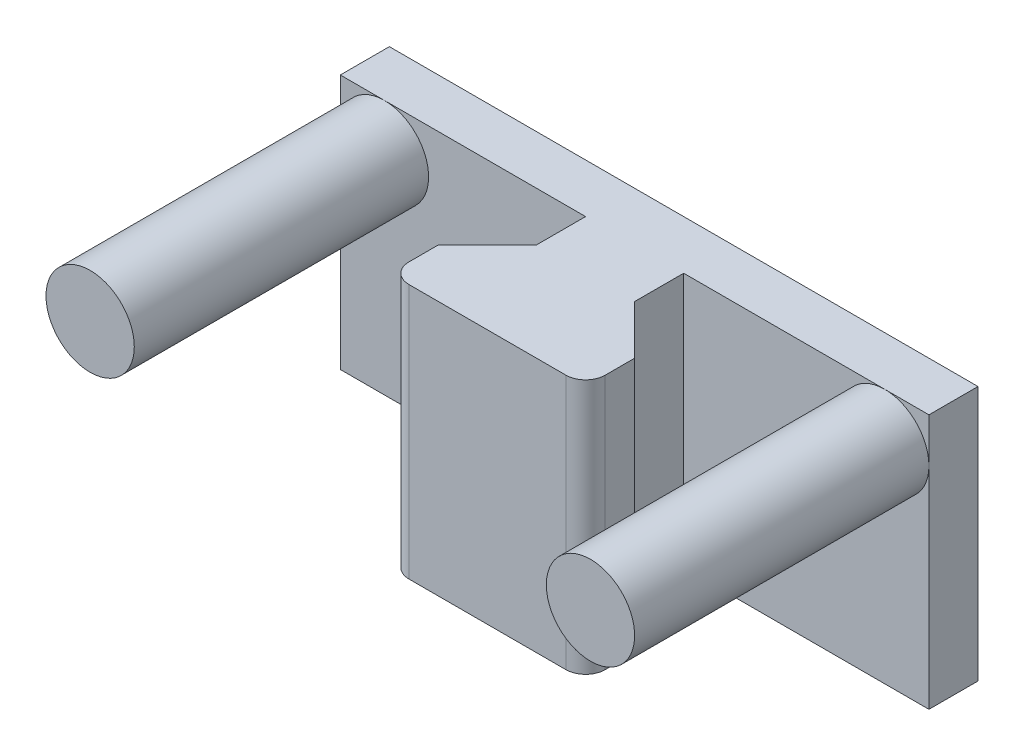
ISO-10303-21;
HEADER;
FILE_DESCRIPTION(('STEP AP214'),'2;1');
FILE_NAME('part.step','',(''),(''),'','','');
FILE_SCHEMA(('AUTOMOTIVE_DESIGN { 1 0 10303 214 1 1 1 1 }'));
ENDSEC;
DATA;
#1=APPLICATION_CONTEXT('core data for automotive mechanical design processes');
#2=APPLICATION_PROTOCOL_DEFINITION('international standard','automotive_design',2000,#1);
#3=PRODUCT_CONTEXT('',#1,'mechanical');
#4=PRODUCT('Part','Part','',(#3));
#5=PRODUCT_RELATED_PRODUCT_CATEGORY('part','',(#4));
#6=PRODUCT_DEFINITION_FORMATION('','',#4);
#7=PRODUCT_DEFINITION_CONTEXT('part definition',#1,'design');
#8=PRODUCT_DEFINITION('design','',#6,#7);
#9=PRODUCT_DEFINITION_SHAPE('','',#8);
#10=(LENGTH_UNIT() NAMED_UNIT(*) SI_UNIT(.MILLI.,.METRE.));
#11=(NAMED_UNIT(*) PLANE_ANGLE_UNIT() SI_UNIT($,.RADIAN.));
#12=(NAMED_UNIT(*) SI_UNIT($,.STERADIAN.) SOLID_ANGLE_UNIT());
#13=UNCERTAINTY_MEASURE_WITH_UNIT(LENGTH_MEASURE(1.E-05),#10,'distance_accuracy_value','');
#14=(GEOMETRIC_REPRESENTATION_CONTEXT(3) GLOBAL_UNCERTAINTY_ASSIGNED_CONTEXT((#13)) GLOBAL_UNIT_ASSIGNED_CONTEXT((#10,
#11,#12)) REPRESENTATION_CONTEXT('',''));
#15=CARTESIAN_POINT('',(0.,0.,0.));
#16=DIRECTION('',(0.,0.,1.));
#17=DIRECTION('',(1.,0.,0.));
#18=AXIS2_PLACEMENT_3D('',#15,#16,#17);
#19=CARTESIAN_POINT('',(0.,26.,-15.));
#20=DIRECTION('',(0.,0.,-1.));
#21=DIRECTION('',(-1.,0.,0.));
#22=AXIS2_PLACEMENT_3D('',#19,#20,#21);
#23=PLANE('',#22);
#24=DIRECTION('',(1.,0.,0.));
#25=VECTOR('',#24,1.);
#26=CARTESIAN_POINT('',(0.,26.,-15.));
#27=LINE('',#26,#25);
#28=CARTESIAN_POINT('',(25.5,26.,-15.));
#29=VERTEX_POINT('',#28);
#30=CARTESIAN_POINT('',(30.,26.,-15.));
#31=VERTEX_POINT('',#30);
#32=EDGE_CURVE('E160',#29,#31,#27,.T.);
#33=ORIENTED_EDGE('',*,*,#32,.F.);
#34=CARTESIAN_POINT('',(25.5,21.5,-15.));
#35=DIRECTION('',(0.,0.,-1.));
#36=DIRECTION('',(-1.,0.,0.));
#37=AXIS2_PLACEMENT_3D('',#34,#35,#36);
#38=CIRCLE('',#37,4.5);
#39=CARTESIAN_POINT('',(30.,21.5,-15.));
#40=VERTEX_POINT('',#39);
#41=EDGE_CURVE('E149',#29,#40,#38,.T.);
#42=ORIENTED_EDGE('',*,*,#41,.T.);
#43=DIRECTION('',(0.,-1.,0.));
#44=VECTOR('',#43,1.);
#45=CARTESIAN_POINT('',(30.,26.,-15.));
#46=LINE('',#45,#44);
#47=EDGE_CURVE('E158',#31,#40,#46,.T.);
#48=ORIENTED_EDGE('',*,*,#47,.F.);
#49=EDGE_LOOP('',(#33,#42,#48));
#50=FACE_BOUND('',#49,.T.);
#51=ADVANCED_FACE('F36',(#50),#23,.F.);
#52=CARTESIAN_POINT('',(0.,26.,-15.));
#53=DIRECTION('',(0.,0.,1.));
#54=DIRECTION('',(1.,0.,0.));
#55=AXIS2_PLACEMENT_3D('',#52,#53,#54);
#56=PLANE('',#55);
#57=DIRECTION('',(0.,-1.,0.));
#58=VECTOR('',#57,1.);
#59=CARTESIAN_POINT('',(-30.,26.,-15.));
#60=LINE('',#59,#58);
#61=CARTESIAN_POINT('',(-30.,26.,-15.));
#62=VERTEX_POINT('',#61);
#63=CARTESIAN_POINT('',(-30.,21.5,-15.));
#64=VERTEX_POINT('',#63);
#65=EDGE_CURVE('E268',#62,#64,#60,.T.);
#66=ORIENTED_EDGE('',*,*,#65,.T.);
#67=CARTESIAN_POINT('',(-25.5,21.5,-15.));
#68=DIRECTION('',(0.,0.,1.));
#69=DIRECTION('',(1.,0.,0.));
#70=AXIS2_PLACEMENT_3D('',#67,#68,#69);
#71=CIRCLE('',#70,4.5);
#72=CARTESIAN_POINT('',(-25.5,26.,-15.));
#73=VERTEX_POINT('',#72);
#74=EDGE_CURVE('E290',#73,#64,#71,.T.);
#75=ORIENTED_EDGE('',*,*,#74,.F.);
#76=DIRECTION('',(-1.,0.,0.));
#77=VECTOR('',#76,1.);
#78=CARTESIAN_POINT('',(0.,26.,-15.));
#79=LINE('',#78,#77);
#80=EDGE_CURVE('E292',#73,#62,#79,.T.);
#81=ORIENTED_EDGE('',*,*,#80,.T.);
#82=EDGE_LOOP('',(#66,#75,#81));
#83=FACE_BOUND('',#82,.T.);
#84=ADVANCED_FACE('F289',(#83),#56,.T.);
#85=CARTESIAN_POINT('',(0.,26.,0.));
#86=DIRECTION('',(0.,0.,1.));
#87=DIRECTION('',(1.,0.,0.));
#88=AXIS2_PLACEMENT_3D('',#85,#86,#87);
#89=PLANE('',#88);
#90=DIRECTION('',(-1.,0.,0.));
#91=VECTOR('',#90,1.);
#92=CARTESIAN_POINT('',(0.,0.,0.));
#93=LINE('',#92,#91);
#94=CARTESIAN_POINT('',(8.,0.,0.));
#95=VERTEX_POINT('',#94);
#96=CARTESIAN_POINT('',(-8.,0.,0.));
#97=VERTEX_POINT('',#96);
#98=EDGE_CURVE('E235',#95,#97,#93,.T.);
#99=ORIENTED_EDGE('',*,*,#98,.F.);
#100=DIRECTION('',(0.,-1.,0.));
#101=VECTOR('',#100,1.);
#102=CARTESIAN_POINT('',(8.,26.,0.));
#103=LINE('',#102,#101);
#104=CARTESIAN_POINT('',(8.,26.,0.));
#105=VERTEX_POINT('',#104);
#106=EDGE_CURVE('E195',#95,#105,#103,.F.);
#107=ORIENTED_EDGE('',*,*,#106,.T.);
#108=DIRECTION('',(-1.,0.,0.));
#109=VECTOR('',#108,1.);
#110=CARTESIAN_POINT('',(0.,26.,0.));
#111=LINE('',#110,#109);
#112=CARTESIAN_POINT('',(-8.,26.,0.));
#113=VERTEX_POINT('',#112);
#114=EDGE_CURVE('E259',#105,#113,#111,.T.);
#115=ORIENTED_EDGE('',*,*,#114,.T.);
#116=DIRECTION('',(0.,-1.,0.));
#117=VECTOR('',#116,1.);
#118=CARTESIAN_POINT('',(-8.,26.,0.));
#119=LINE('',#118,#117);
#120=EDGE_CURVE('E192',#113,#97,#119,.T.);
#121=ORIENTED_EDGE('',*,*,#120,.T.);
#122=EDGE_LOOP('',(#99,#107,#115,#121));
#123=FACE_BOUND('',#122,.T.);
#124=ADVANCED_FACE('F319',(#123),#89,.T.);
#125=CARTESIAN_POINT('',(10.,26.,0.));
#126=DIRECTION('',(-1.,0.,0.));
#127=DIRECTION('',(0.,0.,1.));
#128=AXIS2_PLACEMENT_3D('',#125,#126,#127);
#129=PLANE('',#128);
#130=DIRECTION('',(0.,0.,-1.));
#131=VECTOR('',#130,1.);
#132=CARTESIAN_POINT('',(10.,26.,0.));
#133=LINE('',#132,#131);
#134=CARTESIAN_POINT('',(10.,26.,-2.));
#135=VERTEX_POINT('',#134);
#136=CARTESIAN_POINT('',(10.,26.,-5.));
#137=VERTEX_POINT('',#136);
#138=EDGE_CURVE('E218',#135,#137,#133,.T.);
#139=ORIENTED_EDGE('',*,*,#138,.F.);
#140=DIRECTION('',(0.,-1.,0.));
#141=VECTOR('',#140,1.);
#142=CARTESIAN_POINT('',(10.,0.,-2.));
#143=LINE('',#142,#141);
#144=CARTESIAN_POINT('',(10.,0.,-2.));
#145=VERTEX_POINT('',#144);
#146=EDGE_CURVE('E185',#135,#145,#143,.T.);
#147=ORIENTED_EDGE('',*,*,#146,.T.);
#148=DIRECTION('',(0.,0.,-1.));
#149=VECTOR('',#148,1.);
#150=CARTESIAN_POINT('',(10.,0.,0.));
#151=LINE('',#150,#149);
#152=CARTESIAN_POINT('',(10.,0.,-5.));
#153=VERTEX_POINT('',#152);
#154=EDGE_CURVE('E230',#145,#153,#151,.T.);
#155=ORIENTED_EDGE('',*,*,#154,.T.);
#156=DIRECTION('',(0.,-1.,0.));
#157=VECTOR('',#156,1.);
#158=CARTESIAN_POINT('',(10.,26.,-5.));
#159=LINE('',#158,#157);
#160=EDGE_CURVE('E178',#137,#153,#159,.T.);
#161=ORIENTED_EDGE('',*,*,#160,.F.);
#162=EDGE_LOOP('',(#139,#147,#155,#161));
#163=FACE_BOUND('',#162,.T.);
#164=ADVANCED_FACE('F233',(#163),#129,.F.);
#165=CARTESIAN_POINT('',(5.,26.,0.));
#166=DIRECTION('',(-1.,0.,0.));
#167=DIRECTION('',(0.,0.,1.));
#168=AXIS2_PLACEMENT_3D('',#165,#166,#167);
#169=PLANE('',#168);
#170=DIRECTION('',(0.,0.,-1.));
#171=VECTOR('',#170,1.);
#172=CARTESIAN_POINT('',(5.,26.,0.));
#173=LINE('',#172,#171);
#174=CARTESIAN_POINT('',(5.,26.,-10.));
#175=VERTEX_POINT('',#174);
#176=CARTESIAN_POINT('',(5.,26.,-15.));
#177=VERTEX_POINT('',#176);
#178=EDGE_CURVE('E215',#175,#177,#173,.T.);
#179=ORIENTED_EDGE('',*,*,#178,.F.);
#180=DIRECTION('',(0.,-1.,0.));
#181=VECTOR('',#180,1.);
#182=CARTESIAN_POINT('',(5.,0.,-10.));
#183=LINE('',#182,#181);
#184=CARTESIAN_POINT('',(5.,0.,-10.));
#185=VERTEX_POINT('',#184);
#186=EDGE_CURVE('E203',#175,#185,#183,.T.);
#187=ORIENTED_EDGE('',*,*,#186,.T.);
#188=DIRECTION('',(0.,0.,-1.));
#189=VECTOR('',#188,1.);
#190=CARTESIAN_POINT('',(5.,0.,0.));
#191=LINE('',#190,#189);
#192=CARTESIAN_POINT('',(5.,0.,-15.));
#193=VERTEX_POINT('',#192);
#194=EDGE_CURVE('E231',#185,#193,#191,.T.);
#195=ORIENTED_EDGE('',*,*,#194,.T.);
#196=DIRECTION('',(0.,-1.,0.));
#197=VECTOR('',#196,1.);
#198=CARTESIAN_POINT('',(5.,26.,-15.));
#199=LINE('',#198,#197);
#200=EDGE_CURVE('E177',#177,#193,#199,.T.);
#201=ORIENTED_EDGE('',*,*,#200,.F.);
#202=EDGE_LOOP('',(#179,#187,#195,#201));
#203=FACE_BOUND('',#202,.T.);
#204=ADVANCED_FACE('F223',(#203),#169,.F.);
#205=CARTESIAN_POINT('',(30.,0.,-15.));
#206=VERTEX_POINT('',#205);
#207=EDGE_CURVE('E164',#40,#206,#46,.T.);
#208=ORIENTED_EDGE('',*,*,#207,.F.);
#209=EDGE_CURVE('E146',#40,#29,#38,.T.);
#210=ORIENTED_EDGE('',*,*,#209,.T.);
#211=EDGE_CURVE('E326',#177,#29,#27,.T.);
#212=ORIENTED_EDGE('',*,*,#211,.F.);
#213=ORIENTED_EDGE('',*,*,#200,.T.);
#214=DIRECTION('',(1.,0.,0.));
#215=VECTOR('',#214,1.);
#216=CARTESIAN_POINT('',(0.,0.,-15.));
#217=LINE('',#216,#215);
#218=EDGE_CURVE('E168',#193,#206,#217,.T.);
#219=ORIENTED_EDGE('',*,*,#218,.T.);
#220=EDGE_LOOP('',(#208,#210,#212,#213,#219));
#221=FACE_BOUND('',#220,.T.);
#222=ADVANCED_FACE('F165',(#221),#23,.F.);
#223=CARTESIAN_POINT('',(30.,26.,0.));
#224=DIRECTION('',(-1.,0.,0.));
#225=DIRECTION('',(0.,0.,1.));
#226=AXIS2_PLACEMENT_3D('',#223,#224,#225);
#227=PLANE('',#226);
#228=DIRECTION('',(0.,0.,-1.));
#229=VECTOR('',#228,1.);
#230=CARTESIAN_POINT('',(30.,0.,0.));
#231=LINE('',#230,#229);
#232=CARTESIAN_POINT('',(30.,0.,-20.));
#233=VERTEX_POINT('',#232);
#234=EDGE_CURVE('E244',#206,#233,#231,.T.);
#235=ORIENTED_EDGE('',*,*,#234,.T.);
#236=DIRECTION('',(0.,-1.,0.));
#237=VECTOR('',#236,1.);
#238=CARTESIAN_POINT('',(30.,26.,-20.));
#239=LINE('',#238,#237);
#240=CARTESIAN_POINT('',(30.,26.,-20.));
#241=VERTEX_POINT('',#240);
#242=EDGE_CURVE('E172',#241,#233,#239,.T.);
#243=ORIENTED_EDGE('',*,*,#242,.F.);
#244=DIRECTION('',(0.,0.,-1.));
#245=VECTOR('',#244,1.);
#246=CARTESIAN_POINT('',(30.,26.,0.));
#247=LINE('',#246,#245);
#248=EDGE_CURVE('E176',#31,#241,#247,.T.);
#249=ORIENTED_EDGE('',*,*,#248,.F.);
#250=ORIENTED_EDGE('',*,*,#47,.T.);
#251=ORIENTED_EDGE('',*,*,#207,.T.);
#252=EDGE_LOOP('',(#235,#243,#249,#250,#251));
#253=FACE_BOUND('',#252,.T.);
#254=ADVANCED_FACE('F174',(#253),#227,.F.);
#255=CARTESIAN_POINT('',(0.,26.,-20.));
#256=DIRECTION('',(0.,0.,-1.));
#257=DIRECTION('',(-1.,0.,0.));
#258=AXIS2_PLACEMENT_3D('',#255,#256,#257);
#259=PLANE('',#258);
#260=DIRECTION('',(1.,0.,0.));
#261=VECTOR('',#260,1.);
#262=CARTESIAN_POINT('',(0.,0.,-20.));
#263=LINE('',#262,#261);
#264=CARTESIAN_POINT('',(-30.,0.,-20.));
#265=VERTEX_POINT('',#264);
#266=EDGE_CURVE('E246',#265,#233,#263,.T.);
#267=ORIENTED_EDGE('',*,*,#266,.F.);
#268=DIRECTION('',(0.,-1.,0.));
#269=VECTOR('',#268,1.);
#270=CARTESIAN_POINT('',(-30.,26.,-20.));
#271=LINE('',#270,#269);
#272=CARTESIAN_POINT('',(-30.,26.,-20.));
#273=VERTEX_POINT('',#272);
#274=EDGE_CURVE('E270',#273,#265,#271,.T.);
#275=ORIENTED_EDGE('',*,*,#274,.F.);
#276=DIRECTION('',(1.,0.,0.));
#277=VECTOR('',#276,1.);
#278=CARTESIAN_POINT('',(0.,26.,-20.));
#279=LINE('',#278,#277);
#280=EDGE_CURVE('E279',#273,#241,#279,.T.);
#281=ORIENTED_EDGE('',*,*,#280,.T.);
#282=ORIENTED_EDGE('',*,*,#242,.T.);
#283=EDGE_LOOP('',(#267,#275,#281,#282));
#284=FACE_BOUND('',#283,.T.);
#285=ADVANCED_FACE('F277',(#284),#259,.T.);
#286=CARTESIAN_POINT('',(-30.,26.,0.));
#287=DIRECTION('',(-1.,0.,0.));
#288=DIRECTION('',(0.,0.,1.));
#289=AXIS2_PLACEMENT_3D('',#286,#287,#288);
#290=PLANE('',#289);
#291=DIRECTION('',(0.,0.,-1.));
#292=VECTOR('',#291,1.);
#293=CARTESIAN_POINT('',(-30.,0.,0.));
#294=LINE('',#293,#292);
#295=CARTESIAN_POINT('',(-30.,0.,-15.));
#296=VERTEX_POINT('',#295);
#297=EDGE_CURVE('E249',#296,#265,#294,.T.);
#298=ORIENTED_EDGE('',*,*,#297,.F.);
#299=EDGE_CURVE('E267',#64,#296,#60,.T.);
#300=ORIENTED_EDGE('',*,*,#299,.F.);
#301=ORIENTED_EDGE('',*,*,#65,.F.);
#302=DIRECTION('',(0.,0.,-1.));
#303=VECTOR('',#302,1.);
#304=CARTESIAN_POINT('',(-30.,26.,0.));
#305=LINE('',#304,#303);
#306=EDGE_CURVE('E296',#62,#273,#305,.T.);
#307=ORIENTED_EDGE('',*,*,#306,.T.);
#308=ORIENTED_EDGE('',*,*,#274,.T.);
#309=EDGE_LOOP('',(#298,#300,#301,#307,#308));
#310=FACE_BOUND('',#309,.T.);
#311=ADVANCED_FACE('F282',(#310),#290,.T.);
#312=CARTESIAN_POINT('',(-5.,26.,-15.));
#313=VERTEX_POINT('',#312);
#314=EDGE_CURVE('E295',#313,#73,#79,.T.);
#315=ORIENTED_EDGE('',*,*,#314,.T.);
#316=EDGE_CURVE('E328',#64,#73,#71,.T.);
#317=ORIENTED_EDGE('',*,*,#316,.F.);
#318=ORIENTED_EDGE('',*,*,#299,.T.);
#319=DIRECTION('',(-1.,0.,0.));
#320=VECTOR('',#319,1.);
#321=CARTESIAN_POINT('',(0.,0.,-15.));
#322=LINE('',#321,#320);
#323=CARTESIAN_POINT('',(-5.,0.,-15.));
#324=VERTEX_POINT('',#323);
#325=EDGE_CURVE('E252',#324,#296,#322,.T.);
#326=ORIENTED_EDGE('',*,*,#325,.F.);
#327=DIRECTION('',(0.,-1.,0.));
#328=VECTOR('',#327,1.);
#329=CARTESIAN_POINT('',(-5.,26.,-15.));
#330=LINE('',#329,#328);
#331=EDGE_CURVE('E263',#313,#324,#330,.T.);
#332=ORIENTED_EDGE('',*,*,#331,.F.);
#333=EDGE_LOOP('',(#315,#317,#318,#326,#332));
#334=FACE_BOUND('',#333,.T.);
#335=ADVANCED_FACE('F336',(#334),#56,.T.);
#336=CARTESIAN_POINT('',(-5.,26.,0.));
#337=DIRECTION('',(-1.,0.,0.));
#338=DIRECTION('',(0.,0.,1.));
#339=AXIS2_PLACEMENT_3D('',#336,#337,#338);
#340=PLANE('',#339);
#341=DIRECTION('',(0.,0.,-1.));
#342=VECTOR('',#341,1.);
#343=CARTESIAN_POINT('',(-5.,0.,0.));
#344=LINE('',#343,#342);
#345=CARTESIAN_POINT('',(-5.,0.,-9.99999999999998));
#346=VERTEX_POINT('',#345);
#347=EDGE_CURVE('E255',#346,#324,#344,.T.);
#348=ORIENTED_EDGE('',*,*,#347,.F.);
#349=DIRECTION('',(0.,1.,0.));
#350=VECTOR('',#349,1.);
#351=CARTESIAN_POINT('',(-5.,26.,-9.99999999999998));
#352=LINE('',#351,#350);
#353=CARTESIAN_POINT('',(-5.,26.,-9.99999999999998));
#354=VERTEX_POINT('',#353);
#355=EDGE_CURVE('E51',#346,#354,#352,.T.);
#356=ORIENTED_EDGE('',*,*,#355,.T.);
#357=DIRECTION('',(0.,0.,-1.));
#358=VECTOR('',#357,1.);
#359=CARTESIAN_POINT('',(-5.,26.,0.));
#360=LINE('',#359,#358);
#361=EDGE_CURVE('E298',#354,#313,#360,.T.);
#362=ORIENTED_EDGE('',*,*,#361,.T.);
#363=ORIENTED_EDGE('',*,*,#331,.T.);
#364=EDGE_LOOP('',(#348,#356,#362,#363));
#365=FACE_BOUND('',#364,.T.);
#366=ADVANCED_FACE('F338',(#365),#340,.T.);
#367=CARTESIAN_POINT('',(-10.,26.,0.));
#368=DIRECTION('',(-1.,0.,0.));
#369=DIRECTION('',(0.,0.,1.));
#370=AXIS2_PLACEMENT_3D('',#367,#368,#369);
#371=PLANE('',#370);
#372=DIRECTION('',(0.,0.,-1.));
#373=VECTOR('',#372,1.);
#374=CARTESIAN_POINT('',(-10.,0.,0.));
#375=LINE('',#374,#373);
#376=CARTESIAN_POINT('',(-10.,0.,-2.));
#377=VERTEX_POINT('',#376);
#378=CARTESIAN_POINT('',(-10.,0.,-5.));
#379=VERTEX_POINT('',#378);
#380=EDGE_CURVE('E257',#377,#379,#375,.T.);
#381=ORIENTED_EDGE('',*,*,#380,.F.);
#382=DIRECTION('',(0.,-1.,0.));
#383=VECTOR('',#382,1.);
#384=CARTESIAN_POINT('',(-10.,26.,-2.));
#385=LINE('',#384,#383);
#386=CARTESIAN_POINT('',(-10.,26.,-2.));
#387=VERTEX_POINT('',#386);
#388=EDGE_CURVE('E201',#377,#387,#385,.F.);
#389=ORIENTED_EDGE('',*,*,#388,.T.);
#390=DIRECTION('',(0.,0.,-1.));
#391=VECTOR('',#390,1.);
#392=CARTESIAN_POINT('',(-10.,26.,0.));
#393=LINE('',#392,#391);
#394=CARTESIAN_POINT('',(-10.,26.,-5.));
#395=VERTEX_POINT('',#394);
#396=EDGE_CURVE('E264',#387,#395,#393,.T.);
#397=ORIENTED_EDGE('',*,*,#396,.T.);
#398=DIRECTION('',(0.,-1.,0.));
#399=VECTOR('',#398,1.);
#400=CARTESIAN_POINT('',(-10.,26.,-5.));
#401=LINE('',#400,#399);
#402=EDGE_CURVE('E260',#395,#379,#401,.T.);
#403=ORIENTED_EDGE('',*,*,#402,.T.);
#404=EDGE_LOOP('',(#381,#389,#397,#403));
#405=FACE_BOUND('',#404,.T.);
#406=ADVANCED_FACE('F307',(#405),#371,.T.);
#407=CARTESIAN_POINT('',(0.,26.,0.));
#408=DIRECTION('',(0.,1.,0.));
#409=DIRECTION('',(0.,0.,1.));
#410=AXIS2_PLACEMENT_3D('',#407,#408,#409);
#411=PLANE('',#410);
#412=ORIENTED_EDGE('',*,*,#114,.F.);
#413=CARTESIAN_POINT('',(8.,26.,-2.));
#414=DIRECTION('',(0.,1.,0.));
#415=DIRECTION('',(0.,0.,1.));
#416=AXIS2_PLACEMENT_3D('',#413,#414,#415);
#417=CIRCLE('',#416,2.);
#418=EDGE_CURVE('E199',#105,#135,#417,.T.);
#419=ORIENTED_EDGE('',*,*,#418,.T.);
#420=ORIENTED_EDGE('',*,*,#138,.T.);
#421=DIRECTION('',(0.707106781186544,0.,0.707106781186551));
#422=VECTOR('',#421,1.);
#423=CARTESIAN_POINT('',(5.,26.,-10.));
#424=LINE('',#423,#422);
#425=EDGE_CURVE('E209',#137,#175,#424,.F.);
#426=ORIENTED_EDGE('',*,*,#425,.T.);
#427=ORIENTED_EDGE('',*,*,#178,.T.);
#428=ORIENTED_EDGE('',*,*,#211,.T.);
#429=ORIENTED_EDGE('',*,*,#32,.T.);
#430=ORIENTED_EDGE('',*,*,#248,.T.);
#431=ORIENTED_EDGE('',*,*,#280,.F.);
#432=ORIENTED_EDGE('',*,*,#306,.F.);
#433=ORIENTED_EDGE('',*,*,#80,.F.);
#434=ORIENTED_EDGE('',*,*,#314,.F.);
#435=ORIENTED_EDGE('',*,*,#361,.F.);
#436=DIRECTION('',(0.707106781186552,0.,-0.707106781186544));
#437=VECTOR('',#436,1.);
#438=CARTESIAN_POINT('',(-10.,26.,-5.));
#439=LINE('',#438,#437);
#440=EDGE_CURVE('E11',#354,#395,#439,.F.);
#441=ORIENTED_EDGE('',*,*,#440,.T.);
#442=ORIENTED_EDGE('',*,*,#396,.F.);
#443=CARTESIAN_POINT('',(-8.,26.,-2.));
#444=DIRECTION('',(0.,1.,0.));
#445=DIRECTION('',(0.,0.,1.));
#446=AXIS2_PLACEMENT_3D('',#443,#444,#445);
#447=CIRCLE('',#446,2.);
#448=EDGE_CURVE('E197',#387,#113,#447,.T.);
#449=ORIENTED_EDGE('',*,*,#448,.T.);
#450=EDGE_LOOP('',(#412,#419,#420,#426,#427,#428,#429,#430,#431,#432,#433,#434,#435,#441,#442,#449));
#451=FACE_BOUND('',#450,.T.);
#452=ADVANCED_FACE('F214',(#451),#411,.T.);
#453=CARTESIAN_POINT('',(0.,0.,0.));
#454=DIRECTION('',(0.,1.,0.));
#455=DIRECTION('',(0.,0.,1.));
#456=AXIS2_PLACEMENT_3D('',#453,#454,#455);
#457=PLANE('',#456);
#458=ORIENTED_EDGE('',*,*,#154,.F.);
#459=CARTESIAN_POINT('',(8.,0.,-2.));
#460=DIRECTION('',(0.,1.,0.));
#461=DIRECTION('',(0.,0.,1.));
#462=AXIS2_PLACEMENT_3D('',#459,#460,#461);
#463=CIRCLE('',#462,2.);
#464=EDGE_CURVE('E190',#145,#95,#463,.F.);
#465=ORIENTED_EDGE('',*,*,#464,.T.);
#466=ORIENTED_EDGE('',*,*,#98,.T.);
#467=CARTESIAN_POINT('',(-8.,0.,-2.));
#468=DIRECTION('',(0.,1.,0.));
#469=DIRECTION('',(0.,0.,1.));
#470=AXIS2_PLACEMENT_3D('',#467,#468,#469);
#471=CIRCLE('',#470,2.);
#472=EDGE_CURVE('E188',#97,#377,#471,.F.);
#473=ORIENTED_EDGE('',*,*,#472,.T.);
#474=ORIENTED_EDGE('',*,*,#380,.T.);
#475=DIRECTION('',(-0.707106781186552,0.,0.707106781186544));
#476=VECTOR('',#475,1.);
#477=CARTESIAN_POINT('',(-7.49999999999996,0.,-7.50000000000004));
#478=LINE('',#477,#476);
#479=EDGE_CURVE('E44',#379,#346,#478,.F.);
#480=ORIENTED_EDGE('',*,*,#479,.T.);
#481=ORIENTED_EDGE('',*,*,#347,.T.);
#482=ORIENTED_EDGE('',*,*,#325,.T.);
#483=ORIENTED_EDGE('',*,*,#297,.T.);
#484=ORIENTED_EDGE('',*,*,#266,.T.);
#485=ORIENTED_EDGE('',*,*,#234,.F.);
#486=ORIENTED_EDGE('',*,*,#218,.F.);
#487=ORIENTED_EDGE('',*,*,#194,.F.);
#488=DIRECTION('',(-0.707106781186544,0.,-0.707106781186551));
#489=VECTOR('',#488,1.);
#490=CARTESIAN_POINT('',(7.50000000000004,0.,-7.49999999999996));
#491=LINE('',#490,#489);
#492=EDGE_CURVE('E207',#185,#153,#491,.F.);
#493=ORIENTED_EDGE('',*,*,#492,.T.);
#494=EDGE_LOOP('',(#458,#465,#466,#473,#474,#480,#481,#482,#483,#484,#485,#486,#487,#493));
#495=FACE_BOUND('',#494,.T.);
#496=ADVANCED_FACE('F229',(#495),#457,.F.);
#497=CARTESIAN_POINT('',(-25.5,21.5,15.));
#498=DIRECTION('',(0.,0.,-1.));
#499=DIRECTION('',(-1.,0.,0.));
#500=AXIS2_PLACEMENT_3D('',#497,#498,#499);
#501=CYLINDRICAL_SURFACE('',#500,4.5);
#502=CARTESIAN_POINT('',(-25.5,21.5,15.));
#503=DIRECTION('',(0.,0.,1.));
#504=DIRECTION('',(1.,0.,0.));
#505=AXIS2_PLACEMENT_3D('',#502,#503,#504);
#506=CIRCLE('',#505,4.5);
#507=CARTESIAN_POINT('',(-21.,21.5,15.));
#508=VERTEX_POINT('',#507);
#509=EDGE_CURVE('E239',#508,#508,#506,.T.);
#510=ORIENTED_EDGE('',*,*,#509,.F.);
#511=EDGE_LOOP('',(#510));
#512=FACE_BOUND('',#511,.T.);
#513=ORIENTED_EDGE('',*,*,#74,.T.);
#514=ORIENTED_EDGE('',*,*,#316,.T.);
#515=EDGE_LOOP('',(#513,#514));
#516=FACE_BOUND('',#515,.T.);
#517=ADVANCED_FACE('F335',(#512,#516),#501,.T.);
#518=CARTESIAN_POINT('',(-25.5,21.5,15.));
#519=DIRECTION('',(0.,0.,1.));
#520=DIRECTION('',(1.,0.,0.));
#521=AXIS2_PLACEMENT_3D('',#518,#519,#520);
#522=PLANE('',#521);
#523=ORIENTED_EDGE('',*,*,#509,.T.);
#524=EDGE_LOOP('',(#523));
#525=FACE_BOUND('',#524,.T.);
#526=ADVANCED_FACE('F460',(#525),#522,.T.);
#527=CARTESIAN_POINT('',(25.5,21.5,15.));
#528=DIRECTION('',(0.,0.,-1.));
#529=DIRECTION('',(-1.,0.,0.));
#530=AXIS2_PLACEMENT_3D('',#527,#528,#529);
#531=CYLINDRICAL_SURFACE('',#530,4.5);
#532=CARTESIAN_POINT('',(25.5,21.5,15.));
#533=DIRECTION('',(0.,0.,-1.));
#534=DIRECTION('',(-1.,0.,0.));
#535=AXIS2_PLACEMENT_3D('',#532,#533,#534);
#536=CIRCLE('',#535,4.5);
#537=CARTESIAN_POINT('',(21.,21.5,15.));
#538=VERTEX_POINT('',#537);
#539=EDGE_CURVE('E162',#538,#538,#536,.T.);
#540=ORIENTED_EDGE('',*,*,#539,.T.);
#541=EDGE_LOOP('',(#540));
#542=FACE_BOUND('',#541,.T.);
#543=ORIENTED_EDGE('',*,*,#41,.F.);
#544=ORIENTED_EDGE('',*,*,#209,.F.);
#545=EDGE_LOOP('',(#543,#544));
#546=FACE_BOUND('',#545,.T.);
#547=ADVANCED_FACE('F148',(#542,#546),#531,.T.);
#548=CARTESIAN_POINT('',(25.5,21.5,15.));
#549=DIRECTION('',(0.,0.,1.));
#550=DIRECTION('',(-1.,0.,0.));
#551=AXIS2_PLACEMENT_3D('',#548,#549,#550);
#552=PLANE('',#551);
#553=ORIENTED_EDGE('',*,*,#539,.F.);
#554=EDGE_LOOP('',(#553));
#555=FACE_BOUND('',#554,.T.);
#556=ADVANCED_FACE('F369',(#555),#552,.T.);
#557=CARTESIAN_POINT('',(8.,26.,-2.));
#558=DIRECTION('',(0.,1.,0.));
#559=DIRECTION('',(0.,0.,1.));
#560=AXIS2_PLACEMENT_3D('',#557,#558,#559);
#561=CYLINDRICAL_SURFACE('',#560,2.);
#562=ORIENTED_EDGE('',*,*,#418,.F.);
#563=ORIENTED_EDGE('',*,*,#106,.F.);
#564=ORIENTED_EDGE('',*,*,#464,.F.);
#565=ORIENTED_EDGE('',*,*,#146,.F.);
#566=EDGE_LOOP('',(#562,#563,#564,#565));
#567=FACE_BOUND('',#566,.T.);
#568=ADVANCED_FACE('F366',(#567),#561,.T.);
#569=CARTESIAN_POINT('',(-8.,26.,-2.));
#570=DIRECTION('',(0.,-1.,0.));
#571=DIRECTION('',(0.,0.,-1.));
#572=AXIS2_PLACEMENT_3D('',#569,#570,#571);
#573=CYLINDRICAL_SURFACE('',#572,2.);
#574=ORIENTED_EDGE('',*,*,#448,.F.);
#575=ORIENTED_EDGE('',*,*,#388,.F.);
#576=ORIENTED_EDGE('',*,*,#472,.F.);
#577=ORIENTED_EDGE('',*,*,#120,.F.);
#578=EDGE_LOOP('',(#574,#575,#576,#577));
#579=FACE_BOUND('',#578,.T.);
#580=ADVANCED_FACE('F313',(#579),#573,.T.);
#581=CARTESIAN_POINT('',(5.,26.,-10.));
#582=DIRECTION('',(0.707106781186551,0.,-0.707106781186544));
#583=DIRECTION('',(0.,1.,0.));
#584=AXIS2_PLACEMENT_3D('',#581,#582,#583);
#585=PLANE('',#584);
#586=ORIENTED_EDGE('',*,*,#425,.F.);
#587=ORIENTED_EDGE('',*,*,#160,.T.);
#588=ORIENTED_EDGE('',*,*,#492,.F.);
#589=ORIENTED_EDGE('',*,*,#186,.F.);
#590=EDGE_LOOP('',(#586,#587,#588,#589));
#591=FACE_BOUND('',#590,.T.);
#592=ADVANCED_FACE('F226',(#591),#585,.T.);
#593=CARTESIAN_POINT('',(-10.,26.,-5.));
#594=DIRECTION('',(-0.707106781186543,0.,-0.707106781186551));
#595=DIRECTION('',(0.,1.,0.));
#596=AXIS2_PLACEMENT_3D('',#593,#594,#595);
#597=PLANE('',#596);
#598=ORIENTED_EDGE('',*,*,#440,.F.);
#599=ORIENTED_EDGE('',*,*,#355,.F.);
#600=ORIENTED_EDGE('',*,*,#479,.F.);
#601=ORIENTED_EDGE('',*,*,#402,.F.);
#602=EDGE_LOOP('',(#598,#599,#600,#601));
#603=FACE_BOUND('',#602,.T.);
#604=ADVANCED_FACE('F38',(#603),#597,.T.);
#605=CLOSED_SHELL('',(#51,#84,#124,#164,#204,#222,#254,#285,#311,#335,#366,#406,#452,#496,#517,
#526,#547,#556,#568,#580,#592,#604));
#606=MANIFOLD_SOLID_BREP('B2',#605);
#607=ADVANCED_BREP_SHAPE_REPRESENTATION('',(#18,#606),#14);
#608=SHAPE_DEFINITION_REPRESENTATION(#9,#607);
ENDSEC;
END-ISO-10303-21;
